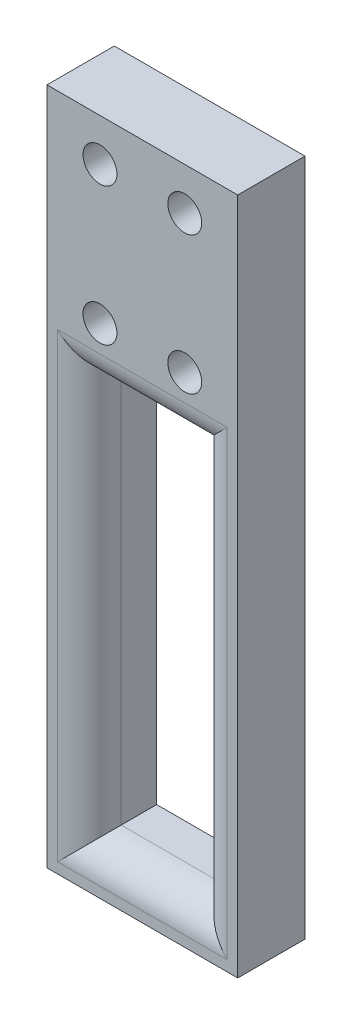
ISO-10303-21;
HEADER;
FILE_DESCRIPTION(('STEP AP214'),'2;1');
FILE_NAME('part.step','',(''),(''),'','','');
FILE_SCHEMA(('AUTOMOTIVE_DESIGN { 1 0 10303 214 1 1 1 1 }'));
ENDSEC;
DATA;
#1=APPLICATION_CONTEXT('core data for automotive mechanical design processes');
#2=APPLICATION_PROTOCOL_DEFINITION('international standard','automotive_design',2000,#1);
#3=PRODUCT_CONTEXT('',#1,'mechanical');
#4=PRODUCT('Part','Part','',(#3));
#5=PRODUCT_RELATED_PRODUCT_CATEGORY('part','',(#4));
#6=PRODUCT_DEFINITION_FORMATION('','',#4);
#7=PRODUCT_DEFINITION_CONTEXT('part definition',#1,'design');
#8=PRODUCT_DEFINITION('design','',#6,#7);
#9=PRODUCT_DEFINITION_SHAPE('','',#8);
#10=(LENGTH_UNIT() NAMED_UNIT(*) SI_UNIT(.MILLI.,.METRE.));
#11=(NAMED_UNIT(*) PLANE_ANGLE_UNIT() SI_UNIT($,.RADIAN.));
#12=(NAMED_UNIT(*) SI_UNIT($,.STERADIAN.) SOLID_ANGLE_UNIT());
#13=UNCERTAINTY_MEASURE_WITH_UNIT(LENGTH_MEASURE(1.E-05),#10,'distance_accuracy_value','');
#14=(GEOMETRIC_REPRESENTATION_CONTEXT(3) GLOBAL_UNCERTAINTY_ASSIGNED_CONTEXT((#13)) GLOBAL_UNIT_ASSIGNED_CONTEXT((#10,
#11,#12)) REPRESENTATION_CONTEXT('',''));
#15=CARTESIAN_POINT('',(0.,0.,0.));
#16=DIRECTION('',(0.,0.,1.));
#17=DIRECTION('',(1.,0.,0.));
#18=AXIS2_PLACEMENT_3D('',#15,#16,#17);
#19=CARTESIAN_POINT('',(9.,-32.,6.35));
#20=DIRECTION('',(-1.,0.,0.));
#21=DIRECTION('',(0.,0.,1.));
#22=AXIS2_PLACEMENT_3D('',#19,#20,#21);
#23=PLANE('',#22);
#24=DIRECTION('',(0.,1.,0.));
#25=VECTOR('',#24,1.);
#26=CARTESIAN_POINT('',(9.,-32.,0.));
#27=LINE('',#26,#25);
#28=CARTESIAN_POINT('',(9.,-32.,0.));
#29=VERTEX_POINT('',#28);
#30=CARTESIAN_POINT('',(9.,32.,0.));
#31=VERTEX_POINT('',#30);
#32=EDGE_CURVE('E203',#29,#31,#27,.T.);
#33=ORIENTED_EDGE('',*,*,#32,.T.);
#34=DIRECTION('',(0.,0.,-1.));
#35=VECTOR('',#34,1.);
#36=CARTESIAN_POINT('',(9.,32.,6.35));
#37=LINE('',#36,#35);
#38=CARTESIAN_POINT('',(9.,32.,6.35));
#39=VERTEX_POINT('',#38);
#40=EDGE_CURVE('E241',#39,#31,#37,.T.);
#41=ORIENTED_EDGE('',*,*,#40,.F.);
#42=DIRECTION('',(0.,1.,0.));
#43=VECTOR('',#42,1.);
#44=CARTESIAN_POINT('',(9.,-32.,6.35));
#45=LINE('',#44,#43);
#46=CARTESIAN_POINT('',(9.,-32.,6.35));
#47=VERTEX_POINT('',#46);
#48=EDGE_CURVE('E204',#47,#39,#45,.T.);
#49=ORIENTED_EDGE('',*,*,#48,.F.);
#50=DIRECTION('',(0.,0.,-1.));
#51=VECTOR('',#50,1.);
#52=CARTESIAN_POINT('',(9.,-32.,6.35));
#53=LINE('',#52,#51);
#54=EDGE_CURVE('E218',#47,#29,#53,.T.);
#55=ORIENTED_EDGE('',*,*,#54,.T.);
#56=EDGE_LOOP('',(#33,#41,#49,#55));
#57=FACE_BOUND('',#56,.T.);
#58=ADVANCED_FACE('F53',(#57),#23,.F.);
#59=CARTESIAN_POINT('',(-9.,32.,6.35));
#60=DIRECTION('',(0.,-1.,0.));
#61=DIRECTION('',(0.,0.,-1.));
#62=AXIS2_PLACEMENT_3D('',#59,#60,#61);
#63=PLANE('',#62);
#64=DIRECTION('',(-1.,0.,0.));
#65=VECTOR('',#64,1.);
#66=CARTESIAN_POINT('',(-9.,32.,0.));
#67=LINE('',#66,#65);
#68=CARTESIAN_POINT('',(-9.,32.,0.));
#69=VERTEX_POINT('',#68);
#70=EDGE_CURVE('E222',#31,#69,#67,.T.);
#71=ORIENTED_EDGE('',*,*,#70,.T.);
#72=DIRECTION('',(0.,0.,-1.));
#73=VECTOR('',#72,1.);
#74=CARTESIAN_POINT('',(-9.,32.,6.35));
#75=LINE('',#74,#73);
#76=CARTESIAN_POINT('',(-9.,32.,6.35));
#77=VERTEX_POINT('',#76);
#78=EDGE_CURVE('E237',#77,#69,#75,.T.);
#79=ORIENTED_EDGE('',*,*,#78,.F.);
#80=DIRECTION('',(-1.,0.,0.));
#81=VECTOR('',#80,1.);
#82=CARTESIAN_POINT('',(-9.,32.,6.35));
#83=LINE('',#82,#81);
#84=EDGE_CURVE('E208',#39,#77,#83,.T.);
#85=ORIENTED_EDGE('',*,*,#84,.F.);
#86=ORIENTED_EDGE('',*,*,#40,.T.);
#87=EDGE_LOOP('',(#71,#79,#85,#86));
#88=FACE_BOUND('',#87,.T.);
#89=ADVANCED_FACE('F300',(#88),#63,.F.);
#90=CARTESIAN_POINT('',(-9.,-32.,6.35));
#91=DIRECTION('',(1.,0.,0.));
#92=DIRECTION('',(0.,0.,-1.));
#93=AXIS2_PLACEMENT_3D('',#90,#91,#92);
#94=PLANE('',#93);
#95=DIRECTION('',(0.,-1.,0.));
#96=VECTOR('',#95,1.);
#97=CARTESIAN_POINT('',(-9.,-32.,0.));
#98=LINE('',#97,#96);
#99=CARTESIAN_POINT('',(-9.,-32.,0.));
#100=VERTEX_POINT('',#99);
#101=EDGE_CURVE('E225',#69,#100,#98,.T.);
#102=ORIENTED_EDGE('',*,*,#101,.T.);
#103=DIRECTION('',(0.,0.,-1.));
#104=VECTOR('',#103,1.);
#105=CARTESIAN_POINT('',(-9.,-32.,6.35));
#106=LINE('',#105,#104);
#107=CARTESIAN_POINT('',(-9.,-32.,6.35));
#108=VERTEX_POINT('',#107);
#109=EDGE_CURVE('E233',#108,#100,#106,.T.);
#110=ORIENTED_EDGE('',*,*,#109,.F.);
#111=DIRECTION('',(0.,-1.,0.));
#112=VECTOR('',#111,1.);
#113=CARTESIAN_POINT('',(-9.,-32.,6.35));
#114=LINE('',#113,#112);
#115=EDGE_CURVE('E212',#77,#108,#114,.T.);
#116=ORIENTED_EDGE('',*,*,#115,.F.);
#117=ORIENTED_EDGE('',*,*,#78,.T.);
#118=EDGE_LOOP('',(#102,#110,#116,#117));
#119=FACE_BOUND('',#118,.T.);
#120=ADVANCED_FACE('F306',(#119),#94,.F.);
#121=CARTESIAN_POINT('',(-9.,-32.,6.35));
#122=DIRECTION('',(0.,1.,0.));
#123=DIRECTION('',(0.,0.,1.));
#124=AXIS2_PLACEMENT_3D('',#121,#122,#123);
#125=PLANE('',#124);
#126=DIRECTION('',(1.,0.,0.));
#127=VECTOR('',#126,1.);
#128=CARTESIAN_POINT('',(-9.,-32.,0.));
#129=LINE('',#128,#127);
#130=EDGE_CURVE('E209',#100,#29,#129,.T.);
#131=ORIENTED_EDGE('',*,*,#130,.T.);
#132=ORIENTED_EDGE('',*,*,#54,.F.);
#133=DIRECTION('',(1.,0.,0.));
#134=VECTOR('',#133,1.);
#135=CARTESIAN_POINT('',(-9.,-32.,6.35));
#136=LINE('',#135,#134);
#137=EDGE_CURVE('E215',#108,#47,#136,.T.);
#138=ORIENTED_EDGE('',*,*,#137,.F.);
#139=ORIENTED_EDGE('',*,*,#109,.T.);
#140=EDGE_LOOP('',(#131,#132,#138,#139));
#141=FACE_BOUND('',#140,.T.);
#142=ADVANCED_FACE('F357',(#141),#125,.F.);
#143=CARTESIAN_POINT('',(0.,0.,6.35));
#144=DIRECTION('',(0.,0.,-1.));
#145=DIRECTION('',(-1.,0.,0.));
#146=AXIS2_PLACEMENT_3D('',#143,#144,#145);
#147=PLANE('',#146);
#148=DIRECTION('',(-1.,0.,0.));
#149=VECTOR('',#148,1.);
#150=CARTESIAN_POINT('',(0.,12.5,6.35));
#151=LINE('',#150,#149);
#152=CARTESIAN_POINT('',(-8.,12.5,6.35));
#153=VERTEX_POINT('',#152);
#154=CARTESIAN_POINT('',(8.,12.5,6.35));
#155=VERTEX_POINT('',#154);
#156=EDGE_CURVE('E250',#153,#155,#151,.F.);
#157=ORIENTED_EDGE('',*,*,#156,.T.);
#158=DIRECTION('',(0.,1.,0.));
#159=VECTOR('',#158,1.);
#160=CARTESIAN_POINT('',(8.,0.,6.35));
#161=LINE('',#160,#159);
#162=CARTESIAN_POINT('',(8.,-31.,6.35));
#163=VERTEX_POINT('',#162);
#164=EDGE_CURVE('E259',#155,#163,#161,.F.);
#165=ORIENTED_EDGE('',*,*,#164,.T.);
#166=DIRECTION('',(1.,0.,0.));
#167=VECTOR('',#166,1.);
#168=CARTESIAN_POINT('',(0.,-31.,6.35));
#169=LINE('',#168,#167);
#170=CARTESIAN_POINT('',(-8.,-31.,6.35));
#171=VERTEX_POINT('',#170);
#172=EDGE_CURVE('E256',#163,#171,#169,.F.);
#173=ORIENTED_EDGE('',*,*,#172,.T.);
#174=DIRECTION('',(0.,-1.,0.));
#175=VECTOR('',#174,1.);
#176=CARTESIAN_POINT('',(-8.,0.,6.35));
#177=LINE('',#176,#175);
#178=EDGE_CURVE('E253',#171,#153,#177,.F.);
#179=ORIENTED_EDGE('',*,*,#178,.T.);
#180=EDGE_LOOP('',(#157,#165,#173,#179));
#181=FACE_BOUND('',#180,.T.);
#182=CARTESIAN_POINT('',(-4.,15.,6.35));
#183=DIRECTION('',(0.,0.,1.));
#184=DIRECTION('',(1.,0.,0.));
#185=AXIS2_PLACEMENT_3D('',#182,#183,#184);
#186=CIRCLE('',#185,1.6);
#187=CARTESIAN_POINT('',(-2.4,15.,6.35));
#188=VERTEX_POINT('',#187);
#189=EDGE_CURVE('E169',#188,#188,#186,.T.);
#190=ORIENTED_EDGE('',*,*,#189,.F.);
#191=EDGE_LOOP('',(#190));
#192=FACE_BOUND('',#191,.T.);
#193=CARTESIAN_POINT('',(-4.,28.,6.35));
#194=DIRECTION('',(0.,0.,1.));
#195=DIRECTION('',(1.,0.,0.));
#196=AXIS2_PLACEMENT_3D('',#193,#194,#195);
#197=CIRCLE('',#196,1.6);
#198=CARTESIAN_POINT('',(-2.4,28.,6.35));
#199=VERTEX_POINT('',#198);
#200=EDGE_CURVE('E182',#199,#199,#197,.T.);
#201=ORIENTED_EDGE('',*,*,#200,.F.);
#202=EDGE_LOOP('',(#201));
#203=FACE_BOUND('',#202,.T.);
#204=CARTESIAN_POINT('',(4.,28.,6.35));
#205=DIRECTION('',(0.,0.,1.));
#206=DIRECTION('',(1.,0.,0.));
#207=AXIS2_PLACEMENT_3D('',#204,#205,#206);
#208=CIRCLE('',#207,1.6);
#209=CARTESIAN_POINT('',(5.6,28.,6.35));
#210=VERTEX_POINT('',#209);
#211=EDGE_CURVE('E187',#210,#210,#208,.T.);
#212=ORIENTED_EDGE('',*,*,#211,.F.);
#213=EDGE_LOOP('',(#212));
#214=FACE_BOUND('',#213,.T.);
#215=CARTESIAN_POINT('',(4.,15.,6.35));
#216=DIRECTION('',(0.,0.,1.));
#217=DIRECTION('',(1.,0.,0.));
#218=AXIS2_PLACEMENT_3D('',#215,#216,#217);
#219=CIRCLE('',#218,1.6);
#220=CARTESIAN_POINT('',(5.6,15.,6.35));
#221=VERTEX_POINT('',#220);
#222=EDGE_CURVE('E195',#221,#221,#219,.T.);
#223=ORIENTED_EDGE('',*,*,#222,.F.);
#224=EDGE_LOOP('',(#223));
#225=FACE_BOUND('',#224,.T.);
#226=ORIENTED_EDGE('',*,*,#48,.T.);
#227=ORIENTED_EDGE('',*,*,#84,.T.);
#228=ORIENTED_EDGE('',*,*,#115,.T.);
#229=ORIENTED_EDGE('',*,*,#137,.T.);
#230=EDGE_LOOP('',(#226,#227,#228,#229));
#231=FACE_BOUND('',#230,.T.);
#232=ADVANCED_FACE('F352',(#181,#192,#203,#214,#225,#231),#147,.F.);
#233=CARTESIAN_POINT('',(0.,0.,0.));
#234=DIRECTION('',(0.,0.,-1.));
#235=DIRECTION('',(-1.,0.,0.));
#236=AXIS2_PLACEMENT_3D('',#233,#234,#235);
#237=PLANE('',#236);
#238=DIRECTION('',(0.,1.,0.));
#239=VECTOR('',#238,1.);
#240=CARTESIAN_POINT('',(5.,-28.,0.));
#241=LINE('',#240,#239);
#242=CARTESIAN_POINT('',(5.,-28.,0.));
#243=VERTEX_POINT('',#242);
#244=CARTESIAN_POINT('',(5.,9.5,0.));
#245=VERTEX_POINT('',#244);
#246=EDGE_CURVE('E137',#243,#245,#241,.T.);
#247=ORIENTED_EDGE('',*,*,#246,.T.);
#248=DIRECTION('',(-1.,0.,0.));
#249=VECTOR('',#248,1.);
#250=CARTESIAN_POINT('',(-5.,9.5,0.));
#251=LINE('',#250,#249);
#252=CARTESIAN_POINT('',(-5.,9.5,0.));
#253=VERTEX_POINT('',#252);
#254=EDGE_CURVE('E146',#245,#253,#251,.T.);
#255=ORIENTED_EDGE('',*,*,#254,.T.);
#256=DIRECTION('',(0.,-1.,0.));
#257=VECTOR('',#256,1.);
#258=CARTESIAN_POINT('',(-5.,-28.,0.));
#259=LINE('',#258,#257);
#260=CARTESIAN_POINT('',(-5.,-28.,0.));
#261=VERTEX_POINT('',#260);
#262=EDGE_CURVE('E151',#253,#261,#259,.T.);
#263=ORIENTED_EDGE('',*,*,#262,.T.);
#264=DIRECTION('',(1.,0.,0.));
#265=VECTOR('',#264,1.);
#266=CARTESIAN_POINT('',(-5.,-28.,0.));
#267=LINE('',#266,#265);
#268=EDGE_CURVE('E143',#261,#243,#267,.T.);
#269=ORIENTED_EDGE('',*,*,#268,.T.);
#270=EDGE_LOOP('',(#247,#255,#263,#269));
#271=FACE_BOUND('',#270,.T.);
#272=CARTESIAN_POINT('',(-4.,15.,0.));
#273=DIRECTION('',(0.,0.,-1.));
#274=DIRECTION('',(-1.,0.,0.));
#275=AXIS2_PLACEMENT_3D('',#272,#273,#274);
#276=CIRCLE('',#275,1.6);
#277=CARTESIAN_POINT('',(-5.6,15.,0.));
#278=VERTEX_POINT('',#277);
#279=EDGE_CURVE('E178',#278,#278,#276,.T.);
#280=ORIENTED_EDGE('',*,*,#279,.F.);
#281=EDGE_LOOP('',(#280));
#282=FACE_BOUND('',#281,.T.);
#283=CARTESIAN_POINT('',(-4.,28.,0.));
#284=DIRECTION('',(0.,0.,-1.));
#285=DIRECTION('',(-1.,0.,0.));
#286=AXIS2_PLACEMENT_3D('',#283,#284,#285);
#287=CIRCLE('',#286,1.6);
#288=CARTESIAN_POINT('',(-5.6,28.,0.));
#289=VERTEX_POINT('',#288);
#290=EDGE_CURVE('E186',#289,#289,#287,.T.);
#291=ORIENTED_EDGE('',*,*,#290,.F.);
#292=EDGE_LOOP('',(#291));
#293=FACE_BOUND('',#292,.T.);
#294=CARTESIAN_POINT('',(4.,28.,0.));
#295=DIRECTION('',(0.,0.,-1.));
#296=DIRECTION('',(-1.,0.,0.));
#297=AXIS2_PLACEMENT_3D('',#294,#295,#296);
#298=CIRCLE('',#297,1.6);
#299=CARTESIAN_POINT('',(2.4,28.,0.));
#300=VERTEX_POINT('',#299);
#301=EDGE_CURVE('E191',#300,#300,#298,.T.);
#302=ORIENTED_EDGE('',*,*,#301,.F.);
#303=EDGE_LOOP('',(#302));
#304=FACE_BOUND('',#303,.T.);
#305=CARTESIAN_POINT('',(4.,15.,0.));
#306=DIRECTION('',(0.,0.,-1.));
#307=DIRECTION('',(-1.,0.,0.));
#308=AXIS2_PLACEMENT_3D('',#305,#306,#307);
#309=CIRCLE('',#308,1.6);
#310=CARTESIAN_POINT('',(2.4,15.,0.));
#311=VERTEX_POINT('',#310);
#312=EDGE_CURVE('E199',#311,#311,#309,.T.);
#313=ORIENTED_EDGE('',*,*,#312,.F.);
#314=EDGE_LOOP('',(#313));
#315=FACE_BOUND('',#314,.T.);
#316=ORIENTED_EDGE('',*,*,#32,.F.);
#317=ORIENTED_EDGE('',*,*,#130,.F.);
#318=ORIENTED_EDGE('',*,*,#101,.F.);
#319=ORIENTED_EDGE('',*,*,#70,.F.);
#320=EDGE_LOOP('',(#316,#317,#318,#319));
#321=FACE_BOUND('',#320,.T.);
#322=ADVANCED_FACE('F153',(#271,#282,#293,#304,#315,#321),#237,.T.);
#323=CARTESIAN_POINT('',(4.,15.,6.35));
#324=DIRECTION('',(0.,0.,1.));
#325=DIRECTION('',(1.,0.,0.));
#326=AXIS2_PLACEMENT_3D('',#323,#324,#325);
#327=CYLINDRICAL_SURFACE('',#326,1.6);
#328=ORIENTED_EDGE('',*,*,#312,.T.);
#329=EDGE_LOOP('',(#328));
#330=FACE_BOUND('',#329,.T.);
#331=ORIENTED_EDGE('',*,*,#222,.T.);
#332=EDGE_LOOP('',(#331));
#333=FACE_BOUND('',#332,.T.);
#334=ADVANCED_FACE('F369',(#330,#333),#327,.F.);
#335=CARTESIAN_POINT('',(4.,28.,6.35));
#336=DIRECTION('',(0.,0.,1.));
#337=DIRECTION('',(1.,0.,0.));
#338=AXIS2_PLACEMENT_3D('',#335,#336,#337);
#339=CYLINDRICAL_SURFACE('',#338,1.6);
#340=ORIENTED_EDGE('',*,*,#301,.T.);
#341=EDGE_LOOP('',(#340));
#342=FACE_BOUND('',#341,.T.);
#343=ORIENTED_EDGE('',*,*,#211,.T.);
#344=EDGE_LOOP('',(#343));
#345=FACE_BOUND('',#344,.T.);
#346=ADVANCED_FACE('F388',(#342,#345),#339,.F.);
#347=CARTESIAN_POINT('',(-4.,28.,6.35));
#348=DIRECTION('',(0.,0.,1.));
#349=DIRECTION('',(1.,0.,0.));
#350=AXIS2_PLACEMENT_3D('',#347,#348,#349);
#351=CYLINDRICAL_SURFACE('',#350,1.6);
#352=ORIENTED_EDGE('',*,*,#290,.T.);
#353=EDGE_LOOP('',(#352));
#354=FACE_BOUND('',#353,.T.);
#355=ORIENTED_EDGE('',*,*,#200,.T.);
#356=EDGE_LOOP('',(#355));
#357=FACE_BOUND('',#356,.T.);
#358=ADVANCED_FACE('F378',(#354,#357),#351,.F.);
#359=CARTESIAN_POINT('',(-4.,15.,6.35));
#360=DIRECTION('',(0.,0.,1.));
#361=DIRECTION('',(1.,0.,0.));
#362=AXIS2_PLACEMENT_3D('',#359,#360,#361);
#363=CYLINDRICAL_SURFACE('',#362,1.6);
#364=ORIENTED_EDGE('',*,*,#279,.T.);
#365=EDGE_LOOP('',(#364));
#366=FACE_BOUND('',#365,.T.);
#367=ORIENTED_EDGE('',*,*,#189,.T.);
#368=EDGE_LOOP('',(#367));
#369=FACE_BOUND('',#368,.T.);
#370=ADVANCED_FACE('F345',(#366,#369),#363,.F.);
#371=CARTESIAN_POINT('',(5.,-28.,0.));
#372=DIRECTION('',(1.,0.,0.));
#373=DIRECTION('',(0.,0.,-1.));
#374=AXIS2_PLACEMENT_3D('',#371,#372,#373);
#375=PLANE('',#374);
#376=DIRECTION('',(0.,0.,1.));
#377=VECTOR('',#376,1.);
#378=CARTESIAN_POINT('',(5.,-28.,0.));
#379=LINE('',#378,#377);
#380=CARTESIAN_POINT('',(5.,-28.,3.35));
#381=VERTEX_POINT('',#380);
#382=EDGE_CURVE('E166',#243,#381,#379,.T.);
#383=ORIENTED_EDGE('',*,*,#382,.T.);
#384=DIRECTION('',(0.,1.,0.));
#385=VECTOR('',#384,1.);
#386=CARTESIAN_POINT('',(5.,-28.,3.35));
#387=LINE('',#386,#385);
#388=CARTESIAN_POINT('',(5.,9.5,3.35));
#389=VERTEX_POINT('',#388);
#390=EDGE_CURVE('E140',#381,#389,#387,.T.);
#391=ORIENTED_EDGE('',*,*,#390,.T.);
#392=DIRECTION('',(0.,0.,1.));
#393=VECTOR('',#392,1.);
#394=CARTESIAN_POINT('',(5.,9.5,0.));
#395=LINE('',#394,#393);
#396=EDGE_CURVE('E132',#245,#389,#395,.T.);
#397=ORIENTED_EDGE('',*,*,#396,.F.);
#398=ORIENTED_EDGE('',*,*,#246,.F.);
#399=EDGE_LOOP('',(#383,#391,#397,#398));
#400=FACE_BOUND('',#399,.T.);
#401=ADVANCED_FACE('F135',(#400),#375,.F.);
#402=CARTESIAN_POINT('',(-5.,-28.,0.));
#403=DIRECTION('',(0.,-1.,0.));
#404=DIRECTION('',(1.,0.,0.));
#405=AXIS2_PLACEMENT_3D('',#402,#403,#404);
#406=PLANE('',#405);
#407=DIRECTION('',(0.,0.,1.));
#408=VECTOR('',#407,1.);
#409=CARTESIAN_POINT('',(-5.,-28.,0.));
#410=LINE('',#409,#408);
#411=CARTESIAN_POINT('',(-5.,-28.,3.35));
#412=VERTEX_POINT('',#411);
#413=EDGE_CURVE('E170',#261,#412,#410,.T.);
#414=ORIENTED_EDGE('',*,*,#413,.T.);
#415=DIRECTION('',(1.,0.,0.));
#416=VECTOR('',#415,1.);
#417=CARTESIAN_POINT('',(-5.,-28.,3.35));
#418=LINE('',#417,#416);
#419=EDGE_CURVE('E263',#412,#381,#418,.T.);
#420=ORIENTED_EDGE('',*,*,#419,.T.);
#421=ORIENTED_EDGE('',*,*,#382,.F.);
#422=ORIENTED_EDGE('',*,*,#268,.F.);
#423=EDGE_LOOP('',(#414,#420,#421,#422));
#424=FACE_BOUND('',#423,.T.);
#425=ADVANCED_FACE('F289',(#424),#406,.F.);
#426=CARTESIAN_POINT('',(-5.,-28.,0.));
#427=DIRECTION('',(-1.,0.,0.));
#428=DIRECTION('',(0.,0.,1.));
#429=AXIS2_PLACEMENT_3D('',#426,#427,#428);
#430=PLANE('',#429);
#431=DIRECTION('',(0.,0.,1.));
#432=VECTOR('',#431,1.);
#433=CARTESIAN_POINT('',(-5.,9.5,0.));
#434=LINE('',#433,#432);
#435=CARTESIAN_POINT('',(-5.,9.5,3.35));
#436=VERTEX_POINT('',#435);
#437=EDGE_CURVE('E142',#253,#436,#434,.T.);
#438=ORIENTED_EDGE('',*,*,#437,.T.);
#439=DIRECTION('',(0.,-1.,0.));
#440=VECTOR('',#439,1.);
#441=CARTESIAN_POINT('',(-5.,-28.,3.35));
#442=LINE('',#441,#440);
#443=EDGE_CURVE('E63',#436,#412,#442,.T.);
#444=ORIENTED_EDGE('',*,*,#443,.T.);
#445=ORIENTED_EDGE('',*,*,#413,.F.);
#446=ORIENTED_EDGE('',*,*,#262,.F.);
#447=EDGE_LOOP('',(#438,#444,#445,#446));
#448=FACE_BOUND('',#447,.T.);
#449=ADVANCED_FACE('F290',(#448),#430,.F.);
#450=CARTESIAN_POINT('',(-5.,9.5,0.));
#451=DIRECTION('',(0.,1.,0.));
#452=DIRECTION('',(0.,0.,1.));
#453=AXIS2_PLACEMENT_3D('',#450,#451,#452);
#454=PLANE('',#453);
#455=ORIENTED_EDGE('',*,*,#396,.T.);
#456=DIRECTION('',(-1.,0.,0.));
#457=VECTOR('',#456,1.);
#458=CARTESIAN_POINT('',(-5.,9.5,3.35));
#459=LINE('',#458,#457);
#460=EDGE_CURVE('E13',#389,#436,#459,.T.);
#461=ORIENTED_EDGE('',*,*,#460,.T.);
#462=ORIENTED_EDGE('',*,*,#437,.F.);
#463=ORIENTED_EDGE('',*,*,#254,.F.);
#464=EDGE_LOOP('',(#455,#461,#462,#463));
#465=FACE_BOUND('',#464,.T.);
#466=ADVANCED_FACE('F147',(#465),#454,.F.);
#467=CARTESIAN_POINT('',(-8.,-28.,3.35));
#468=DIRECTION('',(0.,-1.,0.));
#469=DIRECTION('',(0.,0.,-1.));
#470=AXIS2_PLACEMENT_3D('',#467,#468,#469);
#471=CYLINDRICAL_SURFACE('',#470,3.);
#472=CARTESIAN_POINT('',(-8.,12.5,3.35));
#473=DIRECTION('',(-0.707106781186547,-0.707106781186547,0.));
#474=DIRECTION('',(0.707106781186547,-0.707106781186547,0.));
#475=AXIS2_PLACEMENT_3D('',#472,#473,#474);
#476=ELLIPSE('',#475,4.24264068711928,3.);
#477=EDGE_CURVE('E160',#153,#436,#476,.F.);
#478=ORIENTED_EDGE('',*,*,#477,.F.);
#479=ORIENTED_EDGE('',*,*,#178,.F.);
#480=CARTESIAN_POINT('',(-8.,-31.,3.35));
#481=DIRECTION('',(0.707106781186547,-0.707106781186548,0.));
#482=DIRECTION('',(0.707106781186548,0.707106781186547,0.));
#483=AXIS2_PLACEMENT_3D('',#480,#481,#482);
#484=ELLIPSE('',#483,4.24264068711928,3.);
#485=EDGE_CURVE('E57',#412,#171,#484,.T.);
#486=ORIENTED_EDGE('',*,*,#485,.F.);
#487=ORIENTED_EDGE('',*,*,#443,.F.);
#488=EDGE_LOOP('',(#478,#479,#486,#487));
#489=FACE_BOUND('',#488,.T.);
#490=ADVANCED_FACE('F55',(#489),#471,.T.);
#491=CARTESIAN_POINT('',(-5.,-31.,3.35));
#492=DIRECTION('',(1.,0.,0.));
#493=DIRECTION('',(0.,1.,0.));
#494=AXIS2_PLACEMENT_3D('',#491,#492,#493);
#495=CYLINDRICAL_SURFACE('',#494,3.);
#496=ORIENTED_EDGE('',*,*,#485,.T.);
#497=ORIENTED_EDGE('',*,*,#172,.F.);
#498=CARTESIAN_POINT('',(8.,-31.,3.35));
#499=DIRECTION('',(0.707106781186548,0.707106781186547,0.));
#500=DIRECTION('',(-0.707106781186547,0.707106781186548,0.));
#501=AXIS2_PLACEMENT_3D('',#498,#499,#500);
#502=ELLIPSE('',#501,4.24264068711929,3.);
#503=EDGE_CURVE('E271',#381,#163,#502,.T.);
#504=ORIENTED_EDGE('',*,*,#503,.F.);
#505=ORIENTED_EDGE('',*,*,#419,.F.);
#506=EDGE_LOOP('',(#496,#497,#504,#505));
#507=FACE_BOUND('',#506,.T.);
#508=ADVANCED_FACE('F287',(#507),#495,.T.);
#509=CARTESIAN_POINT('',(-5.,12.5,3.35));
#510=DIRECTION('',(-1.,0.,0.));
#511=DIRECTION('',(0.,0.,1.));
#512=AXIS2_PLACEMENT_3D('',#509,#510,#511);
#513=CYLINDRICAL_SURFACE('',#512,3.);
#514=ORIENTED_EDGE('',*,*,#477,.T.);
#515=ORIENTED_EDGE('',*,*,#460,.F.);
#516=CARTESIAN_POINT('',(8.,12.5,3.35));
#517=DIRECTION('',(-0.707106781186547,0.707106781186547,0.));
#518=DIRECTION('',(0.707106781186547,0.707106781186547,0.));
#519=AXIS2_PLACEMENT_3D('',#516,#517,#518);
#520=ELLIPSE('',#519,4.24264068711928,3.);
#521=EDGE_CURVE('E268',#155,#389,#520,.F.);
#522=ORIENTED_EDGE('',*,*,#521,.F.);
#523=ORIENTED_EDGE('',*,*,#156,.F.);
#524=EDGE_LOOP('',(#514,#515,#522,#523));
#525=FACE_BOUND('',#524,.T.);
#526=ADVANCED_FACE('F278',(#525),#513,.T.);
#527=CARTESIAN_POINT('',(8.,-28.,3.35));
#528=DIRECTION('',(0.,1.,0.));
#529=DIRECTION('',(0.,0.,1.));
#530=AXIS2_PLACEMENT_3D('',#527,#528,#529);
#531=CYLINDRICAL_SURFACE('',#530,3.);
#532=ORIENTED_EDGE('',*,*,#503,.T.);
#533=ORIENTED_EDGE('',*,*,#164,.F.);
#534=ORIENTED_EDGE('',*,*,#521,.T.);
#535=ORIENTED_EDGE('',*,*,#390,.F.);
#536=EDGE_LOOP('',(#532,#533,#534,#535));
#537=FACE_BOUND('',#536,.T.);
#538=ADVANCED_FACE('F311',(#537),#531,.T.);
#539=CLOSED_SHELL('',(#58,#89,#120,#142,#232,#322,#334,#346,#358,#370,#401,#425,#449,#466,#490,
#508,#526,#538));
#540=MANIFOLD_SOLID_BREP('B2',#539);
#541=ADVANCED_BREP_SHAPE_REPRESENTATION('',(#18,#540),#14);
#542=SHAPE_DEFINITION_REPRESENTATION(#9,#541);
ENDSEC;
END-ISO-10303-21;
